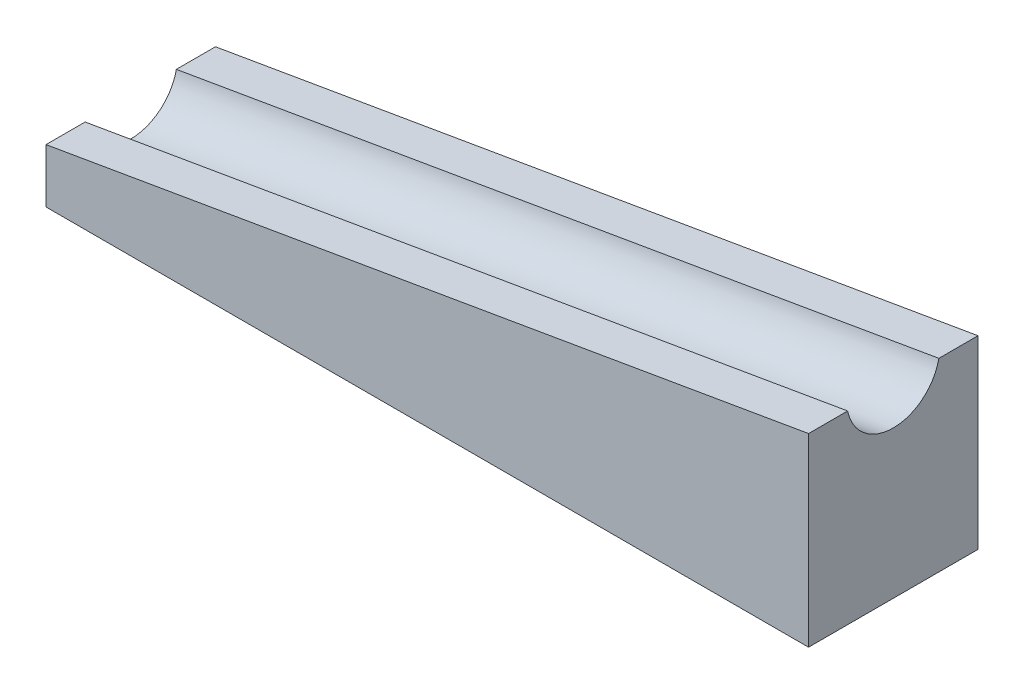
ISO-10303-21;
HEADER;
FILE_DESCRIPTION(('STEP AP214'),'2;1');
FILE_NAME('part.step','',(''),(''),'','','');
FILE_SCHEMA(('AUTOMOTIVE_DESIGN { 1 0 10303 214 1 1 1 1 }'));
ENDSEC;
DATA;
#1=APPLICATION_CONTEXT('core data for automotive mechanical design processes');
#2=APPLICATION_PROTOCOL_DEFINITION('international standard','automotive_design',2000,#1);
#3=PRODUCT_CONTEXT('',#1,'mechanical');
#4=PRODUCT('Part','Part','',(#3));
#5=PRODUCT_RELATED_PRODUCT_CATEGORY('part','',(#4));
#6=PRODUCT_DEFINITION_FORMATION('','',#4);
#7=PRODUCT_DEFINITION_CONTEXT('part definition',#1,'design');
#8=PRODUCT_DEFINITION('design','',#6,#7);
#9=PRODUCT_DEFINITION_SHAPE('','',#8);
#10=(LENGTH_UNIT() NAMED_UNIT(*) SI_UNIT(.MILLI.,.METRE.));
#11=(NAMED_UNIT(*) PLANE_ANGLE_UNIT() SI_UNIT($,.RADIAN.));
#12=(NAMED_UNIT(*) SI_UNIT($,.STERADIAN.) SOLID_ANGLE_UNIT());
#13=UNCERTAINTY_MEASURE_WITH_UNIT(LENGTH_MEASURE(1.E-05),#10,'distance_accuracy_value','');
#14=(GEOMETRIC_REPRESENTATION_CONTEXT(3) GLOBAL_UNCERTAINTY_ASSIGNED_CONTEXT((#13)) GLOBAL_UNIT_ASSIGNED_CONTEXT((#10,
#11,#12)) REPRESENTATION_CONTEXT('',''));
#15=CARTESIAN_POINT('',(0.,0.,0.));
#16=DIRECTION('',(0.,0.,1.));
#17=DIRECTION('',(1.,0.,0.));
#18=AXIS2_PLACEMENT_3D('',#15,#16,#17);
#19=CARTESIAN_POINT('',(90.,15.4648284147107,20.));
#20=DIRECTION('',(0.169349503849018,-0.985556059058079,0.));
#21=DIRECTION('',(0.985556059058079,0.169349503849018,0.));
#22=AXIS2_PLACEMENT_3D('',#19,#20,#21);
#23=PLANE('',#22);
#24=DIRECTION('',(0.,0.,-1.));
#25=VECTOR('',#24,1.);
#26=CARTESIAN_POINT('',(0.,0.,20.));
#27=LINE('',#26,#25);
#28=CARTESIAN_POINT('',(0.,0.,4.6180582127553));
#29=VERTEX_POINT('',#28);
#30=CARTESIAN_POINT('',(0.,0.,0.));
#31=VERTEX_POINT('',#30);
#32=EDGE_CURVE('E85',#29,#31,#27,.T.);
#33=ORIENTED_EDGE('',*,*,#32,.F.);
#34=DIRECTION('',(0.985556059058079,0.169349503849018,0.));
#35=VECTOR('',#34,1.);
#36=CARTESIAN_POINT('',(-1.06458289660488,-0.182928798102559,4.6180582127553));
#37=LINE('',#36,#35);
#38=CARTESIAN_POINT('',(90.,15.4648284147107,4.6180582127553));
#39=VERTEX_POINT('',#38);
#40=EDGE_CURVE('E11',#29,#39,#37,.T.);
#41=ORIENTED_EDGE('',*,*,#40,.T.);
#42=DIRECTION('',(0.,0.,-1.));
#43=VECTOR('',#42,1.);
#44=CARTESIAN_POINT('',(90.,15.4648284147107,20.));
#45=LINE('',#44,#43);
#46=CARTESIAN_POINT('',(90.,15.4648284147107,0.));
#47=VERTEX_POINT('',#46);
#48=EDGE_CURVE('E110',#39,#47,#45,.T.);
#49=ORIENTED_EDGE('',*,*,#48,.T.);
#50=DIRECTION('',(-0.985556059058079,-0.169349503849018,0.));
#51=VECTOR('',#50,1.);
#52=CARTESIAN_POINT('',(90.,15.4648284147107,0.));
#53=LINE('',#52,#51);
#54=EDGE_CURVE('E138',#47,#31,#53,.T.);
#55=ORIENTED_EDGE('',*,*,#54,.T.);
#56=EDGE_LOOP('',(#33,#41,#49,#55));
#57=FACE_BOUND('',#56,.T.);
#58=ADVANCED_FACE('F39',(#57),#23,.F.);
#59=CARTESIAN_POINT('',(0.,-6.37843631523077,20.));
#60=DIRECTION('',(1.,0.,0.));
#61=DIRECTION('',(0.,0.,-1.));
#62=AXIS2_PLACEMENT_3D('',#59,#60,#61);
#63=PLANE('',#62);
#64=CARTESIAN_POINT('',(0.,0.,20.));
#65=VERTEX_POINT('',#64);
#66=CARTESIAN_POINT('',(0.,0.,15.3819417872447));
#67=VERTEX_POINT('',#66);
#68=EDGE_CURVE('E118',#65,#67,#27,.T.);
#69=ORIENTED_EDGE('',*,*,#68,.T.);
#70=CARTESIAN_POINT('',(0.,1.15005859766313,10.));
#71=DIRECTION('',(1.,0.,0.));
#72=DIRECTION('',(0.,1.,0.));
#73=AXIS2_PLACEMENT_3D('',#70,#71,#72);
#74=ELLIPSE('',#73,5.58060594265586,5.5);
#75=EDGE_CURVE('E55',#67,#29,#74,.T.);
#76=ORIENTED_EDGE('',*,*,#75,.T.);
#77=ORIENTED_EDGE('',*,*,#32,.T.);
#78=DIRECTION('',(0.,-1.,0.));
#79=VECTOR('',#78,1.);
#80=CARTESIAN_POINT('',(0.,-6.37843631523077,0.));
#81=LINE('',#80,#79);
#82=CARTESIAN_POINT('',(0.,-6.37843631523077,0.));
#83=VERTEX_POINT('',#82);
#84=EDGE_CURVE('E150',#31,#83,#81,.T.);
#85=ORIENTED_EDGE('',*,*,#84,.T.);
#86=DIRECTION('',(0.,0.,-1.));
#87=VECTOR('',#86,1.);
#88=CARTESIAN_POINT('',(0.,-6.37843631523077,20.));
#89=LINE('',#88,#87);
#90=CARTESIAN_POINT('',(0.,-6.37843631523077,20.));
#91=VERTEX_POINT('',#90);
#92=EDGE_CURVE('E129',#91,#83,#89,.T.);
#93=ORIENTED_EDGE('',*,*,#92,.F.);
#94=DIRECTION('',(0.,-1.,0.));
#95=VECTOR('',#94,1.);
#96=CARTESIAN_POINT('',(0.,-6.37843631523077,20.));
#97=LINE('',#96,#95);
#98=EDGE_CURVE('E136',#65,#91,#97,.T.);
#99=ORIENTED_EDGE('',*,*,#98,.F.);
#100=EDGE_LOOP('',(#69,#76,#77,#85,#93,#99));
#101=FACE_BOUND('',#100,.T.);
#102=ADVANCED_FACE('F41',(#101),#63,.F.);
#103=CARTESIAN_POINT('',(0.,-6.37843631523077,20.));
#104=DIRECTION('',(0.,1.,0.));
#105=DIRECTION('',(0.,0.,1.));
#106=AXIS2_PLACEMENT_3D('',#103,#104,#105);
#107=PLANE('',#106);
#108=DIRECTION('',(1.,0.,0.));
#109=VECTOR('',#108,1.);
#110=CARTESIAN_POINT('',(0.,-6.37843631523077,0.));
#111=LINE('',#110,#109);
#112=CARTESIAN_POINT('',(90.,-6.37843631523077,0.));
#113=VERTEX_POINT('',#112);
#114=EDGE_CURVE('E153',#83,#113,#111,.T.);
#115=ORIENTED_EDGE('',*,*,#114,.T.);
#116=DIRECTION('',(0.,0.,-1.));
#117=VECTOR('',#116,1.);
#118=CARTESIAN_POINT('',(90.,-6.37843631523077,20.));
#119=LINE('',#118,#117);
#120=CARTESIAN_POINT('',(90.,-6.37843631523077,20.));
#121=VERTEX_POINT('',#120);
#122=EDGE_CURVE('E122',#121,#113,#119,.T.);
#123=ORIENTED_EDGE('',*,*,#122,.F.);
#124=DIRECTION('',(1.,0.,0.));
#125=VECTOR('',#124,1.);
#126=CARTESIAN_POINT('',(0.,-6.37843631523077,20.));
#127=LINE('',#126,#125);
#128=EDGE_CURVE('E93',#91,#121,#127,.T.);
#129=ORIENTED_EDGE('',*,*,#128,.F.);
#130=ORIENTED_EDGE('',*,*,#92,.T.);
#131=EDGE_LOOP('',(#115,#123,#129,#130));
#132=FACE_BOUND('',#131,.T.);
#133=ADVANCED_FACE('F159',(#132),#107,.F.);
#134=CARTESIAN_POINT('',(90.,0.,20.));
#135=DIRECTION('',(-1.,0.,0.));
#136=DIRECTION('',(0.,0.,1.));
#137=AXIS2_PLACEMENT_3D('',#134,#135,#136);
#138=PLANE('',#137);
#139=ORIENTED_EDGE('',*,*,#48,.F.);
#140=CARTESIAN_POINT('',(90.,16.6148870123738,10.));
#141=DIRECTION('',(-1.,0.,0.));
#142=DIRECTION('',(0.,1.,0.));
#143=AXIS2_PLACEMENT_3D('',#140,#141,#142);
#144=ELLIPSE('',#143,5.58060594265586,5.5);
#145=CARTESIAN_POINT('',(90.,15.4648284147107,15.3819417872447));
#146=VERTEX_POINT('',#145);
#147=EDGE_CURVE('E101',#39,#146,#144,.T.);
#148=ORIENTED_EDGE('',*,*,#147,.T.);
#149=CARTESIAN_POINT('',(90.,15.4648284147107,20.));
#150=VERTEX_POINT('',#149);
#151=EDGE_CURVE('E117',#150,#146,#45,.T.);
#152=ORIENTED_EDGE('',*,*,#151,.F.);
#153=DIRECTION('',(0.,1.,0.));
#154=VECTOR('',#153,1.);
#155=CARTESIAN_POINT('',(90.,-6.37843631523077,20.));
#156=LINE('',#155,#154);
#157=EDGE_CURVE('E142',#121,#150,#156,.T.);
#158=ORIENTED_EDGE('',*,*,#157,.F.);
#159=ORIENTED_EDGE('',*,*,#122,.T.);
#160=DIRECTION('',(0.,1.,0.));
#161=VECTOR('',#160,1.);
#162=CARTESIAN_POINT('',(90.,0.,0.));
#163=LINE('',#162,#161);
#164=EDGE_CURVE('E114',#113,#47,#163,.T.);
#165=ORIENTED_EDGE('',*,*,#164,.T.);
#166=EDGE_LOOP('',(#139,#148,#152,#158,#159,#165));
#167=FACE_BOUND('',#166,.T.);
#168=ADVANCED_FACE('F112',(#167),#138,.F.);
#169=ORIENTED_EDGE('',*,*,#151,.T.);
#170=DIRECTION('',(0.985556059058079,0.169349503849018,0.));
#171=VECTOR('',#170,1.);
#172=CARTESIAN_POINT('',(-1.06458289660488,-0.182928798102559,15.3819417872447));
#173=LINE('',#172,#171);
#174=EDGE_CURVE('E48',#146,#67,#173,.F.);
#175=ORIENTED_EDGE('',*,*,#174,.T.);
#176=ORIENTED_EDGE('',*,*,#68,.F.);
#177=DIRECTION('',(-0.985556059058079,-0.169349503849018,0.));
#178=VECTOR('',#177,1.);
#179=CARTESIAN_POINT('',(90.,15.4648284147107,20.));
#180=LINE('',#179,#178);
#181=EDGE_CURVE('E64',#150,#65,#180,.T.);
#182=ORIENTED_EDGE('',*,*,#181,.F.);
#183=EDGE_LOOP('',(#169,#175,#176,#182));
#184=FACE_BOUND('',#183,.T.);
#185=ADVANCED_FACE('F133',(#184),#23,.F.);
#186=CARTESIAN_POINT('',(0.,0.,20.));
#187=DIRECTION('',(0.,0.,-1.));
#188=DIRECTION('',(-1.,0.,0.));
#189=AXIS2_PLACEMENT_3D('',#186,#187,#188);
#190=PLANE('',#189);
#191=ORIENTED_EDGE('',*,*,#98,.T.);
#192=ORIENTED_EDGE('',*,*,#128,.T.);
#193=ORIENTED_EDGE('',*,*,#157,.T.);
#194=ORIENTED_EDGE('',*,*,#181,.T.);
#195=EDGE_LOOP('',(#191,#192,#193,#194));
#196=FACE_BOUND('',#195,.T.);
#197=ADVANCED_FACE('F163',(#196),#190,.F.);
#198=CARTESIAN_POINT('',(0.,0.,0.));
#199=DIRECTION('',(0.,0.,-1.));
#200=DIRECTION('',(-1.,0.,0.));
#201=AXIS2_PLACEMENT_3D('',#198,#199,#200);
#202=PLANE('',#201);
#203=ORIENTED_EDGE('',*,*,#84,.F.);
#204=ORIENTED_EDGE('',*,*,#54,.F.);
#205=ORIENTED_EDGE('',*,*,#164,.F.);
#206=ORIENTED_EDGE('',*,*,#114,.F.);
#207=EDGE_LOOP('',(#203,#204,#205,#206));
#208=FACE_BOUND('',#207,.T.);
#209=ADVANCED_FACE('F165',(#208),#202,.T.);
#210=CARTESIAN_POINT('',(-1.25653162081524,0.93414697640129,10.));
#211=DIRECTION('',(0.985556059058079,0.169349503849018,0.));
#212=DIRECTION('',(-0.169349503849018,0.985556059058079,0.));
#213=AXIS2_PLACEMENT_3D('',#210,#211,#212);
#214=CYLINDRICAL_SURFACE('',#213,5.5);
#215=ORIENTED_EDGE('',*,*,#174,.F.);
#216=ORIENTED_EDGE('',*,*,#147,.F.);
#217=ORIENTED_EDGE('',*,*,#40,.F.);
#218=ORIENTED_EDGE('',*,*,#75,.F.);
#219=EDGE_LOOP('',(#215,#216,#217,#218));
#220=FACE_BOUND('',#219,.T.);
#221=ADVANCED_FACE('F102',(#220),#214,.F.);
#222=CLOSED_SHELL('',(#58,#102,#133,#168,#185,#197,#209,#221));
#223=MANIFOLD_SOLID_BREP('B2',#222);
#224=ADVANCED_BREP_SHAPE_REPRESENTATION('',(#18,#223),#14);
#225=SHAPE_DEFINITION_REPRESENTATION(#9,#224);
ENDSEC;
END-ISO-10303-21;
